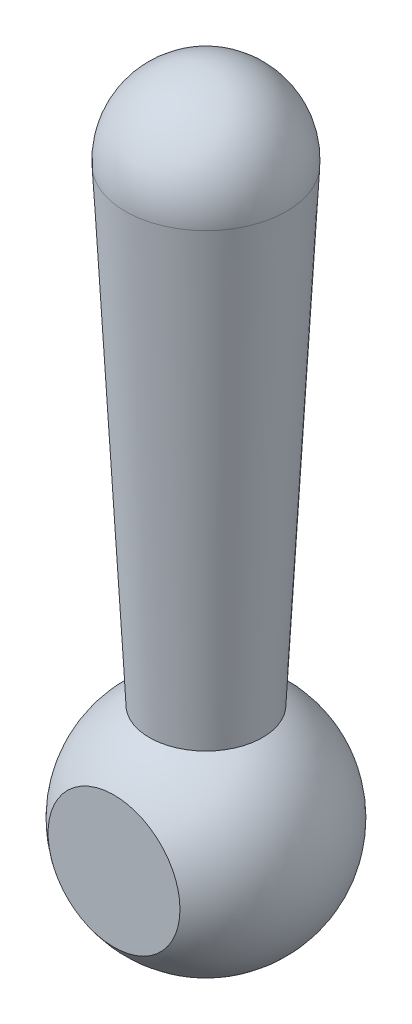
ISO-10303-21;
HEADER;
FILE_DESCRIPTION(('STEP AP214'),'2;1');
FILE_NAME('part.step','',(''),(''),'','','');
FILE_SCHEMA(('AUTOMOTIVE_DESIGN { 1 0 10303 214 1 1 1 1 }'));
ENDSEC;
DATA;
#1=APPLICATION_CONTEXT('core data for automotive mechanical design processes');
#2=APPLICATION_PROTOCOL_DEFINITION('international standard','automotive_design',2000,#1);
#3=PRODUCT_CONTEXT('',#1,'mechanical');
#4=PRODUCT('Part','Part','',(#3));
#5=PRODUCT_RELATED_PRODUCT_CATEGORY('part','',(#4));
#6=PRODUCT_DEFINITION_FORMATION('','',#4);
#7=PRODUCT_DEFINITION_CONTEXT('part definition',#1,'design');
#8=PRODUCT_DEFINITION('design','',#6,#7);
#9=PRODUCT_DEFINITION_SHAPE('','',#8);
#10=(LENGTH_UNIT() NAMED_UNIT(*) SI_UNIT(.MILLI.,.METRE.));
#11=(NAMED_UNIT(*) PLANE_ANGLE_UNIT() SI_UNIT($,.RADIAN.));
#12=(NAMED_UNIT(*) SI_UNIT($,.STERADIAN.) SOLID_ANGLE_UNIT());
#13=UNCERTAINTY_MEASURE_WITH_UNIT(LENGTH_MEASURE(1.E-05),#10,'distance_accuracy_value','');
#14=(GEOMETRIC_REPRESENTATION_CONTEXT(3) GLOBAL_UNCERTAINTY_ASSIGNED_CONTEXT((#13)) GLOBAL_UNIT_ASSIGNED_CONTEXT((#10,
#11,#12)) REPRESENTATION_CONTEXT('',''));
#15=CARTESIAN_POINT('',(0.,0.,0.));
#16=DIRECTION('',(0.,0.,1.));
#17=DIRECTION('',(1.,0.,0.));
#18=AXIS2_PLACEMENT_3D('',#15,#16,#17);
#19=CARTESIAN_POINT('',(0.,0.,0.));
#20=DIRECTION('',(0.,-1.,0.));
#21=DIRECTION('',(-1.,0.,0.));
#22=AXIS2_PLACEMENT_3D('',#19,#20,#21);
#23=SPHERICAL_SURFACE('',#22,4.);
#24=CARTESIAN_POINT('',(0.,3.46410161513775,0.));
#25=DIRECTION('',(0.,-1.,0.));
#26=DIRECTION('',(0.,0.,-1.));
#27=AXIS2_PLACEMENT_3D('',#24,#25,#26);
#28=CIRCLE('',#27,2.);
#29=CARTESIAN_POINT('',(0.,3.46410161513775,-2.));
#30=VERTEX_POINT('',#29);
#31=EDGE_CURVE('E39',#30,#30,#28,.T.);
#32=ORIENTED_EDGE('',*,*,#31,.T.);
#33=EDGE_LOOP('',(#32));
#34=FACE_BOUND('',#33,.T.);
#35=CARTESIAN_POINT('',(0.,0.,-3.25015193066634));
#36=DIRECTION('',(0.,0.,-1.));
#37=DIRECTION('',(-1.,0.,0.));
#38=AXIS2_PLACEMENT_3D('',#35,#36,#37);
#39=CIRCLE('',#38,2.33163299590348);
#40=CARTESIAN_POINT('',(-2.33163299590348,0.,-3.25015193066634));
#41=VERTEX_POINT('',#40);
#42=EDGE_CURVE('E45',#41,#41,#39,.T.);
#43=ORIENTED_EDGE('',*,*,#42,.F.);
#44=EDGE_LOOP('',(#43));
#45=FACE_BOUND('',#44,.T.);
#46=CARTESIAN_POINT('',(0.,0.,3.25015193066634));
#47=DIRECTION('',(0.,0.,1.));
#48=DIRECTION('',(1.,0.,0.));
#49=AXIS2_PLACEMENT_3D('',#46,#47,#48);
#50=CIRCLE('',#49,2.33163299590348);
#51=CARTESIAN_POINT('',(2.33163299590348,0.,3.25015193066634));
#52=VERTEX_POINT('',#51);
#53=EDGE_CURVE('E35',#52,#52,#50,.T.);
#54=ORIENTED_EDGE('',*,*,#53,.F.);
#55=EDGE_LOOP('',(#54));
#56=FACE_BOUND('',#55,.T.);
#57=ADVANCED_FACE('F32',(#34,#45,#56),#23,.T.);
#58=CARTESIAN_POINT('',(0.,20.1462370848872,0.));
#59=DIRECTION('',(0.,-1.,0.));
#60=DIRECTION('',(-1.,0.,0.));
#61=AXIS2_PLACEMENT_3D('',#58,#59,#60);
#62=SPHERICAL_SURFACE('',#61,2.85376291511285);
#63=CARTESIAN_POINT('',(0.,19.999735290791,0.));
#64=DIRECTION('',(0.,-1.,0.));
#65=DIRECTION('',(0.,0.,-1.));
#66=AXIS2_PLACEMENT_3D('',#63,#64,#65);
#67=CIRCLE('',#66,2.85);
#68=CARTESIAN_POINT('',(0.,19.999735290791,-2.85));
#69=VERTEX_POINT('',#68);
#70=EDGE_CURVE('E11',#69,#69,#67,.T.);
#71=ORIENTED_EDGE('',*,*,#70,.F.);
#72=EDGE_LOOP('',(#71));
#73=FACE_BOUND('',#72,.T.);
#74=ADVANCED_FACE('F55',(#73),#62,.T.);
#75=CARTESIAN_POINT('',(0.,19.999735290791,0.));
#76=DIRECTION('',(0.,1.,0.));
#77=DIRECTION('',(0.,0.,1.));
#78=AXIS2_PLACEMENT_3D('',#75,#76,#77);
#79=CONICAL_SURFACE('',#78,2.85,0.051358933411567);
#80=ORIENTED_EDGE('',*,*,#31,.F.);
#81=EDGE_LOOP('',(#80));
#82=FACE_BOUND('',#81,.T.);
#83=ORIENTED_EDGE('',*,*,#70,.T.);
#84=EDGE_LOOP('',(#83));
#85=FACE_BOUND('',#84,.T.);
#86=ADVANCED_FACE('F60',(#82,#85),#79,.T.);
#87=CARTESIAN_POINT('',(-4.,24.0672177055906,-3.25015193066634));
#88=DIRECTION('',(0.,0.,-1.));
#89=DIRECTION('',(-1.,0.,0.));
#90=AXIS2_PLACEMENT_3D('',#87,#88,#89);
#91=PLANE('',#90);
#92=ORIENTED_EDGE('',*,*,#42,.T.);
#93=EDGE_LOOP('',(#92));
#94=FACE_BOUND('',#93,.T.);
#95=ADVANCED_FACE('F66',(#94),#91,.T.);
#96=CARTESIAN_POINT('',(-4.,24.0672177055906,3.25015193066634));
#97=DIRECTION('',(0.,0.,1.));
#98=DIRECTION('',(1.,0.,0.));
#99=AXIS2_PLACEMENT_3D('',#96,#97,#98);
#100=PLANE('',#99);
#101=ORIENTED_EDGE('',*,*,#53,.T.);
#102=EDGE_LOOP('',(#101));
#103=FACE_BOUND('',#102,.T.);
#104=ADVANCED_FACE('F52',(#103),#100,.T.);
#105=CLOSED_SHELL('',(#57,#74,#86,#95,#104));
#106=MANIFOLD_SOLID_BREP('B2',#105);
#107=ADVANCED_BREP_SHAPE_REPRESENTATION('',(#18,#106),#14);
#108=SHAPE_DEFINITION_REPRESENTATION(#9,#107);
ENDSEC;
END-ISO-10303-21;
